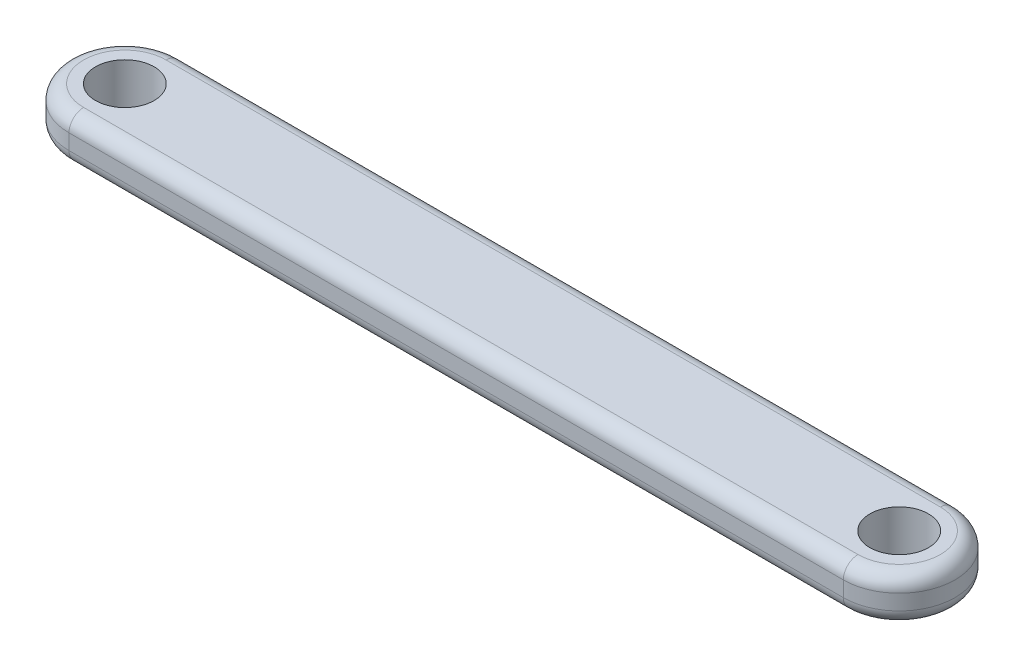
ISO-10303-21;
HEADER;
FILE_DESCRIPTION(('STEP AP214'),'2;1');
FILE_NAME('part.step','',(''),(''),'','','');
FILE_SCHEMA(('AUTOMOTIVE_DESIGN { 1 0 10303 214 1 1 1 1 }'));
ENDSEC;
DATA;
#1=APPLICATION_CONTEXT('core data for automotive mechanical design processes');
#2=APPLICATION_PROTOCOL_DEFINITION('international standard','automotive_design',2000,#1);
#3=PRODUCT_CONTEXT('',#1,'mechanical');
#4=PRODUCT('Part','Part','',(#3));
#5=PRODUCT_RELATED_PRODUCT_CATEGORY('part','',(#4));
#6=PRODUCT_DEFINITION_FORMATION('','',#4);
#7=PRODUCT_DEFINITION_CONTEXT('part definition',#1,'design');
#8=PRODUCT_DEFINITION('design','',#6,#7);
#9=PRODUCT_DEFINITION_SHAPE('','',#8);
#10=(LENGTH_UNIT() NAMED_UNIT(*) SI_UNIT(.MILLI.,.METRE.));
#11=(NAMED_UNIT(*) PLANE_ANGLE_UNIT() SI_UNIT($,.RADIAN.));
#12=(NAMED_UNIT(*) SI_UNIT($,.STERADIAN.) SOLID_ANGLE_UNIT());
#13=UNCERTAINTY_MEASURE_WITH_UNIT(LENGTH_MEASURE(1.E-05),#10,'distance_accuracy_value','');
#14=(GEOMETRIC_REPRESENTATION_CONTEXT(3) GLOBAL_UNCERTAINTY_ASSIGNED_CONTEXT((#13)) GLOBAL_UNIT_ASSIGNED_CONTEXT((#10,
#11,#12)) REPRESENTATION_CONTEXT('',''));
#15=CARTESIAN_POINT('',(0.,0.,0.));
#16=DIRECTION('',(0.,0.,1.));
#17=DIRECTION('',(1.,0.,0.));
#18=AXIS2_PLACEMENT_3D('',#15,#16,#17);
#19=CARTESIAN_POINT('',(-26.418872232,1.524,0.));
#20=DIRECTION('',(0.,1.,0.));
#21=DIRECTION('',(0.,0.,1.));
#22=AXIS2_PLACEMENT_3D('',#19,#20,#21);
#23=PLANE('',#22);
#24=DIRECTION('',(-1.,0.,0.));
#25=VECTOR('',#24,1.);
#26=CARTESIAN_POINT('',(-26.418872232,1.524,-2.81000000000001));
#27=LINE('',#26,#25);
#28=CARTESIAN_POINT('',(26.418872232,1.524,-2.81000000000001));
#29=VERTEX_POINT('',#28);
#30=CARTESIAN_POINT('',(-26.418872232,1.524,-2.81000000000001));
#31=VERTEX_POINT('',#30);
#32=EDGE_CURVE('E63',#29,#31,#27,.T.);
#33=ORIENTED_EDGE('',*,*,#32,.T.);
#34=CARTESIAN_POINT('',(-26.418872232,1.524,0.));
#35=DIRECTION('',(0.,1.,0.));
#36=DIRECTION('',(0.,0.,1.));
#37=AXIS2_PLACEMENT_3D('',#34,#35,#36);
#38=CIRCLE('',#37,2.81);
#39=CARTESIAN_POINT('',(-26.418872232,1.524,2.81));
#40=VERTEX_POINT('',#39);
#41=EDGE_CURVE('E123',#31,#40,#38,.T.);
#42=ORIENTED_EDGE('',*,*,#41,.T.);
#43=DIRECTION('',(1.,0.,0.));
#44=VECTOR('',#43,1.);
#45=CARTESIAN_POINT('',(26.418872232,1.524,2.80999999999999));
#46=LINE('',#45,#44);
#47=CARTESIAN_POINT('',(26.418872232,1.524,2.80999999999999));
#48=VERTEX_POINT('',#47);
#49=EDGE_CURVE('E147',#40,#48,#46,.T.);
#50=ORIENTED_EDGE('',*,*,#49,.T.);
#51=CARTESIAN_POINT('',(26.418872232,1.524,0.));
#52=DIRECTION('',(0.,1.,0.));
#53=DIRECTION('',(0.,0.,1.));
#54=AXIS2_PLACEMENT_3D('',#51,#52,#53);
#55=CIRCLE('',#54,2.81);
#56=EDGE_CURVE('E68',#48,#29,#55,.T.);
#57=ORIENTED_EDGE('',*,*,#56,.T.);
#58=EDGE_LOOP('',(#33,#42,#50,#57));
#59=FACE_BOUND('',#58,.T.);
#60=CARTESIAN_POINT('',(-26.418872232,1.524,0.));
#61=DIRECTION('',(0.,1.,0.));
#62=DIRECTION('',(0.,0.,1.));
#63=AXIS2_PLACEMENT_3D('',#60,#61,#62);
#64=CIRCLE('',#63,2.);
#65=CARTESIAN_POINT('',(-26.418872232,1.524,2.));
#66=VERTEX_POINT('',#65);
#67=EDGE_CURVE('E194',#66,#66,#64,.T.);
#68=ORIENTED_EDGE('',*,*,#67,.F.);
#69=EDGE_LOOP('',(#68));
#70=FACE_BOUND('',#69,.T.);
#71=CARTESIAN_POINT('',(26.418872232,1.524,0.));
#72=DIRECTION('',(0.,1.,0.));
#73=DIRECTION('',(0.,0.,1.));
#74=AXIS2_PLACEMENT_3D('',#71,#72,#73);
#75=CIRCLE('',#74,2.);
#76=CARTESIAN_POINT('',(26.418872232,1.524,1.99999999999999));
#77=VERTEX_POINT('',#76);
#78=EDGE_CURVE('E185',#77,#77,#75,.T.);
#79=ORIENTED_EDGE('',*,*,#78,.F.);
#80=EDGE_LOOP('',(#79));
#81=FACE_BOUND('',#80,.T.);
#82=ADVANCED_FACE('F45',(#59,#70,#81),#23,.T.);
#83=CARTESIAN_POINT('',(-26.418872232,-1.524,0.));
#84=DIRECTION('',(0.,1.,0.));
#85=DIRECTION('',(0.,0.,1.));
#86=AXIS2_PLACEMENT_3D('',#83,#84,#85);
#87=PLANE('',#86);
#88=DIRECTION('',(1.,0.,0.));
#89=VECTOR('',#88,1.);
#90=CARTESIAN_POINT('',(-26.418872232,-1.524,2.81));
#91=LINE('',#90,#89);
#92=CARTESIAN_POINT('',(26.418872232,-1.524,2.80999999999999));
#93=VERTEX_POINT('',#92);
#94=CARTESIAN_POINT('',(-26.418872232,-1.524,2.81));
#95=VERTEX_POINT('',#94);
#96=EDGE_CURVE('E212',#93,#95,#91,.F.);
#97=ORIENTED_EDGE('',*,*,#96,.T.);
#98=CARTESIAN_POINT('',(-26.418872232,-1.524,0.));
#99=DIRECTION('',(0.,1.,0.));
#100=DIRECTION('',(0.,0.,1.));
#101=AXIS2_PLACEMENT_3D('',#98,#99,#100);
#102=CIRCLE('',#101,2.81);
#103=CARTESIAN_POINT('',(-26.418872232,-1.524,-2.81000000000001));
#104=VERTEX_POINT('',#103);
#105=EDGE_CURVE('E221',#95,#104,#102,.F.);
#106=ORIENTED_EDGE('',*,*,#105,.T.);
#107=DIRECTION('',(-1.,0.,0.));
#108=VECTOR('',#107,1.);
#109=CARTESIAN_POINT('',(-26.418872232,-1.524,-2.81000000000001));
#110=LINE('',#109,#108);
#111=CARTESIAN_POINT('',(26.418872232,-1.524,-2.81000000000001));
#112=VERTEX_POINT('',#111);
#113=EDGE_CURVE('E218',#104,#112,#110,.F.);
#114=ORIENTED_EDGE('',*,*,#113,.T.);
#115=CARTESIAN_POINT('',(26.418872232,-1.524,0.));
#116=DIRECTION('',(0.,1.,0.));
#117=DIRECTION('',(0.,0.,1.));
#118=AXIS2_PLACEMENT_3D('',#115,#116,#117);
#119=CIRCLE('',#118,2.81);
#120=EDGE_CURVE('E215',#112,#93,#119,.F.);
#121=ORIENTED_EDGE('',*,*,#120,.T.);
#122=EDGE_LOOP('',(#97,#106,#114,#121));
#123=FACE_BOUND('',#122,.T.);
#124=CARTESIAN_POINT('',(-26.418872232,-1.524,0.));
#125=DIRECTION('',(0.,1.,0.));
#126=DIRECTION('',(0.,0.,1.));
#127=AXIS2_PLACEMENT_3D('',#124,#125,#126);
#128=CIRCLE('',#127,2.);
#129=CARTESIAN_POINT('',(-26.418872232,-1.524,2.));
#130=VERTEX_POINT('',#129);
#131=EDGE_CURVE('E191',#130,#130,#128,.T.);
#132=ORIENTED_EDGE('',*,*,#131,.T.);
#133=EDGE_LOOP('',(#132));
#134=FACE_BOUND('',#133,.T.);
#135=CARTESIAN_POINT('',(26.418872232,-1.524,0.));
#136=DIRECTION('',(0.,1.,0.));
#137=DIRECTION('',(0.,0.,1.));
#138=AXIS2_PLACEMENT_3D('',#135,#136,#137);
#139=CIRCLE('',#138,2.);
#140=CARTESIAN_POINT('',(26.418872232,-1.524,1.99999999999999));
#141=VERTEX_POINT('',#140);
#142=EDGE_CURVE('E178',#141,#141,#139,.T.);
#143=ORIENTED_EDGE('',*,*,#142,.T.);
#144=EDGE_LOOP('',(#143));
#145=FACE_BOUND('',#144,.T.);
#146=ADVANCED_FACE('F270',(#123,#134,#145),#87,.F.);
#147=CARTESIAN_POINT('',(-26.418872232,1.524,0.));
#148=DIRECTION('',(0.,-1.,0.));
#149=DIRECTION('',(0.,0.,-1.));
#150=AXIS2_PLACEMENT_3D('',#147,#148,#149);
#151=CYLINDRICAL_SURFACE('',#150,3.81);
#152=DIRECTION('',(0.,-1.,0.));
#153=VECTOR('',#152,1.);
#154=CARTESIAN_POINT('',(-26.418872232,1.524,-3.81000000000001));
#155=LINE('',#154,#153);
#156=CARTESIAN_POINT('',(-26.418872232,0.524,-3.81000000000001));
#157=VERTEX_POINT('',#156);
#158=CARTESIAN_POINT('',(-26.418872232,-0.523999999999999,-3.81000000000001));
#159=VERTEX_POINT('',#158);
#160=EDGE_CURVE('E198',#157,#159,#155,.T.);
#161=ORIENTED_EDGE('',*,*,#160,.T.);
#162=CARTESIAN_POINT('',(-26.418872232,-0.524,0.));
#163=DIRECTION('',(0.,1.,0.));
#164=DIRECTION('',(0.,0.,1.));
#165=AXIS2_PLACEMENT_3D('',#162,#163,#164);
#166=CIRCLE('',#165,3.81);
#167=CARTESIAN_POINT('',(-26.418872232,-0.523999999999999,3.81));
#168=VERTEX_POINT('',#167);
#169=EDGE_CURVE('E134',#159,#168,#166,.T.);
#170=ORIENTED_EDGE('',*,*,#169,.T.);
#171=DIRECTION('',(0.,-1.,0.));
#172=VECTOR('',#171,1.);
#173=CARTESIAN_POINT('',(-26.418872232,1.524,3.81));
#174=LINE('',#173,#172);
#175=CARTESIAN_POINT('',(-26.418872232,0.524,3.81));
#176=VERTEX_POINT('',#175);
#177=EDGE_CURVE('E115',#176,#168,#174,.T.);
#178=ORIENTED_EDGE('',*,*,#177,.F.);
#179=CARTESIAN_POINT('',(-26.418872232,0.524,0.));
#180=DIRECTION('',(0.,1.,0.));
#181=DIRECTION('',(0.,0.,1.));
#182=AXIS2_PLACEMENT_3D('',#179,#180,#181);
#183=CIRCLE('',#182,3.81);
#184=EDGE_CURVE('E131',#176,#157,#183,.F.);
#185=ORIENTED_EDGE('',*,*,#184,.T.);
#186=EDGE_LOOP('',(#161,#170,#178,#185));
#187=FACE_BOUND('',#186,.T.);
#188=ADVANCED_FACE('F130',(#187),#151,.T.);
#189=CARTESIAN_POINT('',(26.418872232,1.524,3.80999999999999));
#190=DIRECTION('',(0.,0.,-1.));
#191=DIRECTION('',(-1.,0.,0.));
#192=AXIS2_PLACEMENT_3D('',#189,#190,#191);
#193=PLANE('',#192);
#194=ORIENTED_EDGE('',*,*,#177,.T.);
#195=DIRECTION('',(1.,0.,0.));
#196=VECTOR('',#195,1.);
#197=CARTESIAN_POINT('',(26.418872232,-0.524,3.80999999999999));
#198=LINE('',#197,#196);
#199=CARTESIAN_POINT('',(26.418872232,-0.523999999999999,3.80999999999999));
#200=VERTEX_POINT('',#199);
#201=EDGE_CURVE('E11',#168,#200,#198,.T.);
#202=ORIENTED_EDGE('',*,*,#201,.T.);
#203=DIRECTION('',(0.,-1.,0.));
#204=VECTOR('',#203,1.);
#205=CARTESIAN_POINT('',(26.418872232,1.524,3.80999999999999));
#206=LINE('',#205,#204);
#207=CARTESIAN_POINT('',(26.418872232,0.524,3.80999999999999));
#208=VERTEX_POINT('',#207);
#209=EDGE_CURVE('E117',#208,#200,#206,.T.);
#210=ORIENTED_EDGE('',*,*,#209,.F.);
#211=DIRECTION('',(1.,0.,0.));
#212=VECTOR('',#211,1.);
#213=CARTESIAN_POINT('',(-26.418872232,0.524,3.81));
#214=LINE('',#213,#212);
#215=EDGE_CURVE('E55',#208,#176,#214,.F.);
#216=ORIENTED_EDGE('',*,*,#215,.T.);
#217=EDGE_LOOP('',(#194,#202,#210,#216));
#218=FACE_BOUND('',#217,.T.);
#219=ADVANCED_FACE('F114',(#218),#193,.F.);
#220=CARTESIAN_POINT('',(26.418872232,1.524,0.));
#221=DIRECTION('',(0.,-1.,0.));
#222=DIRECTION('',(0.,0.,-1.));
#223=AXIS2_PLACEMENT_3D('',#220,#221,#222);
#224=CYLINDRICAL_SURFACE('',#223,3.81);
#225=ORIENTED_EDGE('',*,*,#209,.T.);
#226=CARTESIAN_POINT('',(26.418872232,-0.524,0.));
#227=DIRECTION('',(0.,1.,0.));
#228=DIRECTION('',(0.,0.,1.));
#229=AXIS2_PLACEMENT_3D('',#226,#227,#228);
#230=CIRCLE('',#229,3.81);
#231=CARTESIAN_POINT('',(26.418872232,-0.523999999999999,-3.81000000000001));
#232=VERTEX_POINT('',#231);
#233=EDGE_CURVE('E234',#200,#232,#230,.T.);
#234=ORIENTED_EDGE('',*,*,#233,.T.);
#235=DIRECTION('',(0.,-1.,0.));
#236=VECTOR('',#235,1.);
#237=CARTESIAN_POINT('',(26.418872232,1.524,-3.81000000000001));
#238=LINE('',#237,#236);
#239=CARTESIAN_POINT('',(26.418872232,0.524,-3.81000000000001));
#240=VERTEX_POINT('',#239);
#241=EDGE_CURVE('E204',#240,#232,#238,.T.);
#242=ORIENTED_EDGE('',*,*,#241,.F.);
#243=CARTESIAN_POINT('',(26.418872232,0.524,0.));
#244=DIRECTION('',(0.,1.,0.));
#245=DIRECTION('',(0.,0.,1.));
#246=AXIS2_PLACEMENT_3D('',#243,#244,#245);
#247=CIRCLE('',#246,3.81);
#248=EDGE_CURVE('E231',#240,#208,#247,.F.);
#249=ORIENTED_EDGE('',*,*,#248,.T.);
#250=EDGE_LOOP('',(#225,#234,#242,#249));
#251=FACE_BOUND('',#250,.T.);
#252=ADVANCED_FACE('F252',(#251),#224,.T.);
#253=CARTESIAN_POINT('',(-26.418872232,1.524,-3.81000000000001));
#254=DIRECTION('',(0.,0.,1.));
#255=DIRECTION('',(1.,0.,0.));
#256=AXIS2_PLACEMENT_3D('',#253,#254,#255);
#257=PLANE('',#256);
#258=ORIENTED_EDGE('',*,*,#241,.T.);
#259=DIRECTION('',(-1.,0.,0.));
#260=VECTOR('',#259,1.);
#261=CARTESIAN_POINT('',(-26.418872232,-0.524,-3.81000000000001));
#262=LINE('',#261,#260);
#263=EDGE_CURVE('E228',#232,#159,#262,.T.);
#264=ORIENTED_EDGE('',*,*,#263,.T.);
#265=ORIENTED_EDGE('',*,*,#160,.F.);
#266=DIRECTION('',(-1.,0.,0.));
#267=VECTOR('',#266,1.);
#268=CARTESIAN_POINT('',(26.418872232,0.524,-3.81000000000002));
#269=LINE('',#268,#267);
#270=EDGE_CURVE('E225',#157,#240,#269,.F.);
#271=ORIENTED_EDGE('',*,*,#270,.T.);
#272=EDGE_LOOP('',(#258,#264,#265,#271));
#273=FACE_BOUND('',#272,.T.);
#274=ADVANCED_FACE('F250',(#273),#257,.F.);
#275=CARTESIAN_POINT('',(-26.418872232,1.524,0.));
#276=DIRECTION('',(0.,-1.,0.));
#277=DIRECTION('',(0.,0.,-1.));
#278=AXIS2_PLACEMENT_3D('',#275,#276,#277);
#279=CYLINDRICAL_SURFACE('',#278,2.);
#280=ORIENTED_EDGE('',*,*,#67,.T.);
#281=EDGE_LOOP('',(#280));
#282=FACE_BOUND('',#281,.T.);
#283=ORIENTED_EDGE('',*,*,#131,.F.);
#284=EDGE_LOOP('',(#283));
#285=FACE_BOUND('',#284,.T.);
#286=ADVANCED_FACE('F279',(#282,#285),#279,.F.);
#287=CARTESIAN_POINT('',(26.418872232,1.524,0.));
#288=DIRECTION('',(0.,-1.,0.));
#289=DIRECTION('',(0.,0.,-1.));
#290=AXIS2_PLACEMENT_3D('',#287,#288,#289);
#291=CYLINDRICAL_SURFACE('',#290,2.);
#292=ORIENTED_EDGE('',*,*,#78,.T.);
#293=EDGE_LOOP('',(#292));
#294=FACE_BOUND('',#293,.T.);
#295=ORIENTED_EDGE('',*,*,#142,.F.);
#296=EDGE_LOOP('',(#295));
#297=FACE_BOUND('',#296,.T.);
#298=ADVANCED_FACE('F315',(#294,#297),#291,.F.);
#299=CARTESIAN_POINT('',(26.418872232,-0.524,0.));
#300=DIRECTION('',(0.,1.,0.));
#301=DIRECTION('',(0.,0.,1.));
#302=AXIS2_PLACEMENT_3D('',#299,#300,#301);
#303=TOROIDAL_SURFACE('',#302,2.81,1.);
#304=CARTESIAN_POINT('',(26.418872232,-0.524,2.80999999999999));
#305=DIRECTION('',(-1.,0.,0.));
#306=DIRECTION('',(0.,0.,1.));
#307=AXIS2_PLACEMENT_3D('',#304,#305,#306);
#308=CIRCLE('',#307,1.);
#309=EDGE_CURVE('E169',#93,#200,#308,.T.);
#310=ORIENTED_EDGE('',*,*,#309,.F.);
#311=ORIENTED_EDGE('',*,*,#120,.F.);
#312=CARTESIAN_POINT('',(26.418872232,-0.524,-2.81000000000001));
#313=DIRECTION('',(-1.,0.,0.));
#314=DIRECTION('',(0.,0.,1.));
#315=AXIS2_PLACEMENT_3D('',#312,#313,#314);
#316=CIRCLE('',#315,1.);
#317=EDGE_CURVE('E154',#232,#112,#316,.T.);
#318=ORIENTED_EDGE('',*,*,#317,.F.);
#319=ORIENTED_EDGE('',*,*,#233,.F.);
#320=EDGE_LOOP('',(#310,#311,#318,#319));
#321=FACE_BOUND('',#320,.T.);
#322=ADVANCED_FACE('F255',(#321),#303,.T.);
#323=CARTESIAN_POINT('',(-26.418872232,-0.524,-2.81000000000001));
#324=DIRECTION('',(-1.,0.,0.));
#325=DIRECTION('',(0.,0.,1.));
#326=AXIS2_PLACEMENT_3D('',#323,#324,#325);
#327=CYLINDRICAL_SURFACE('',#326,1.);
#328=ORIENTED_EDGE('',*,*,#317,.T.);
#329=ORIENTED_EDGE('',*,*,#113,.F.);
#330=CARTESIAN_POINT('',(-26.418872232,-0.524,-2.81000000000001));
#331=DIRECTION('',(-1.,0.,0.));
#332=DIRECTION('',(0.,0.,1.));
#333=AXIS2_PLACEMENT_3D('',#330,#331,#332);
#334=CIRCLE('',#333,1.);
#335=EDGE_CURVE('E162',#159,#104,#334,.T.);
#336=ORIENTED_EDGE('',*,*,#335,.F.);
#337=ORIENTED_EDGE('',*,*,#263,.F.);
#338=EDGE_LOOP('',(#328,#329,#336,#337));
#339=FACE_BOUND('',#338,.T.);
#340=ADVANCED_FACE('F258',(#339),#327,.T.);
#341=CARTESIAN_POINT('',(26.418872232,-0.524,2.80999999999999));
#342=DIRECTION('',(1.,0.,0.));
#343=DIRECTION('',(0.,0.,-1.));
#344=AXIS2_PLACEMENT_3D('',#341,#342,#343);
#345=CYLINDRICAL_SURFACE('',#344,1.);
#346=ORIENTED_EDGE('',*,*,#309,.T.);
#347=ORIENTED_EDGE('',*,*,#201,.F.);
#348=CARTESIAN_POINT('',(-26.418872232,-0.524,2.81));
#349=DIRECTION('',(-1.,0.,0.));
#350=DIRECTION('',(0.,0.,1.));
#351=AXIS2_PLACEMENT_3D('',#348,#349,#350);
#352=CIRCLE('',#351,1.);
#353=EDGE_CURVE('E159',#95,#168,#352,.T.);
#354=ORIENTED_EDGE('',*,*,#353,.F.);
#355=ORIENTED_EDGE('',*,*,#96,.F.);
#356=EDGE_LOOP('',(#346,#347,#354,#355));
#357=FACE_BOUND('',#356,.T.);
#358=ADVANCED_FACE('F261',(#357),#345,.T.);
#359=CARTESIAN_POINT('',(-26.418872232,-0.524,0.));
#360=DIRECTION('',(0.,1.,0.));
#361=DIRECTION('',(0.,0.,1.));
#362=AXIS2_PLACEMENT_3D('',#359,#360,#361);
#363=TOROIDAL_SURFACE('',#362,2.81,1.);
#364=ORIENTED_EDGE('',*,*,#335,.T.);
#365=ORIENTED_EDGE('',*,*,#105,.F.);
#366=ORIENTED_EDGE('',*,*,#353,.T.);
#367=ORIENTED_EDGE('',*,*,#169,.F.);
#368=EDGE_LOOP('',(#364,#365,#366,#367));
#369=FACE_BOUND('',#368,.T.);
#370=ADVANCED_FACE('F259',(#369),#363,.T.);
#371=CARTESIAN_POINT('',(26.418872232,0.524,0.));
#372=DIRECTION('',(0.,1.,0.));
#373=DIRECTION('',(0.,0.,1.));
#374=AXIS2_PLACEMENT_3D('',#371,#372,#373);
#375=TOROIDAL_SURFACE('',#374,2.81,1.);
#376=CARTESIAN_POINT('',(26.418872232,0.524,2.80999999999999));
#377=DIRECTION('',(-1.,0.,0.));
#378=DIRECTION('',(0.,0.,1.));
#379=AXIS2_PLACEMENT_3D('',#376,#377,#378);
#380=CIRCLE('',#379,1.);
#381=EDGE_CURVE('E151',#208,#48,#380,.T.);
#382=ORIENTED_EDGE('',*,*,#381,.F.);
#383=ORIENTED_EDGE('',*,*,#248,.F.);
#384=CARTESIAN_POINT('',(26.418872232,0.524,-2.81000000000001));
#385=DIRECTION('',(-1.,0.,0.));
#386=DIRECTION('',(0.,0.,1.));
#387=AXIS2_PLACEMENT_3D('',#384,#385,#386);
#388=CIRCLE('',#387,1.);
#389=EDGE_CURVE('E49',#29,#240,#388,.T.);
#390=ORIENTED_EDGE('',*,*,#389,.F.);
#391=ORIENTED_EDGE('',*,*,#56,.F.);
#392=EDGE_LOOP('',(#382,#383,#390,#391));
#393=FACE_BOUND('',#392,.T.);
#394=ADVANCED_FACE('F47',(#393),#375,.T.);
#395=CARTESIAN_POINT('',(-26.418872232,0.524,-2.81000000000001));
#396=DIRECTION('',(1.,0.,0.));
#397=DIRECTION('',(0.,0.,-1.));
#398=AXIS2_PLACEMENT_3D('',#395,#396,#397);
#399=CYLINDRICAL_SURFACE('',#398,1.);
#400=ORIENTED_EDGE('',*,*,#389,.T.);
#401=ORIENTED_EDGE('',*,*,#270,.F.);
#402=CARTESIAN_POINT('',(-26.418872232,0.524,-2.81000000000001));
#403=DIRECTION('',(-1.,0.,0.));
#404=DIRECTION('',(0.,0.,1.));
#405=AXIS2_PLACEMENT_3D('',#402,#403,#404);
#406=CIRCLE('',#405,1.);
#407=EDGE_CURVE('E142',#31,#157,#406,.T.);
#408=ORIENTED_EDGE('',*,*,#407,.F.);
#409=ORIENTED_EDGE('',*,*,#32,.F.);
#410=EDGE_LOOP('',(#400,#401,#408,#409));
#411=FACE_BOUND('',#410,.T.);
#412=ADVANCED_FACE('F247',(#411),#399,.T.);
#413=CARTESIAN_POINT('',(-26.418872232,0.524,2.81));
#414=DIRECTION('',(-1.,0.,0.));
#415=DIRECTION('',(0.,0.,1.));
#416=AXIS2_PLACEMENT_3D('',#413,#414,#415);
#417=CYLINDRICAL_SURFACE('',#416,1.);
#418=ORIENTED_EDGE('',*,*,#381,.T.);
#419=ORIENTED_EDGE('',*,*,#49,.F.);
#420=CARTESIAN_POINT('',(-26.418872232,0.524,2.81));
#421=DIRECTION('',(-1.,0.,0.));
#422=DIRECTION('',(0.,0.,1.));
#423=AXIS2_PLACEMENT_3D('',#420,#421,#422);
#424=CIRCLE('',#423,1.);
#425=EDGE_CURVE('E140',#176,#40,#424,.T.);
#426=ORIENTED_EDGE('',*,*,#425,.F.);
#427=ORIENTED_EDGE('',*,*,#215,.F.);
#428=EDGE_LOOP('',(#418,#419,#426,#427));
#429=FACE_BOUND('',#428,.T.);
#430=ADVANCED_FACE('F146',(#429),#417,.T.);
#431=CARTESIAN_POINT('',(-26.418872232,0.524,0.));
#432=DIRECTION('',(0.,1.,0.));
#433=DIRECTION('',(0.,0.,1.));
#434=AXIS2_PLACEMENT_3D('',#431,#432,#433);
#435=TOROIDAL_SURFACE('',#434,2.81,1.);
#436=ORIENTED_EDGE('',*,*,#407,.T.);
#437=ORIENTED_EDGE('',*,*,#184,.F.);
#438=ORIENTED_EDGE('',*,*,#425,.T.);
#439=ORIENTED_EDGE('',*,*,#41,.F.);
#440=EDGE_LOOP('',(#436,#437,#438,#439));
#441=FACE_BOUND('',#440,.T.);
#442=ADVANCED_FACE('F138',(#441),#435,.T.);
#443=CLOSED_SHELL('',(#82,#146,#188,#219,#252,#274,#286,#298,#322,#340,#358,#370,#394,#412,#430,#442));
#444=MANIFOLD_SOLID_BREP('B2',#443);
#445=ADVANCED_BREP_SHAPE_REPRESENTATION('',(#18,#444),#14);
#446=SHAPE_DEFINITION_REPRESENTATION(#9,#445);
ENDSEC;
END-ISO-10303-21;
